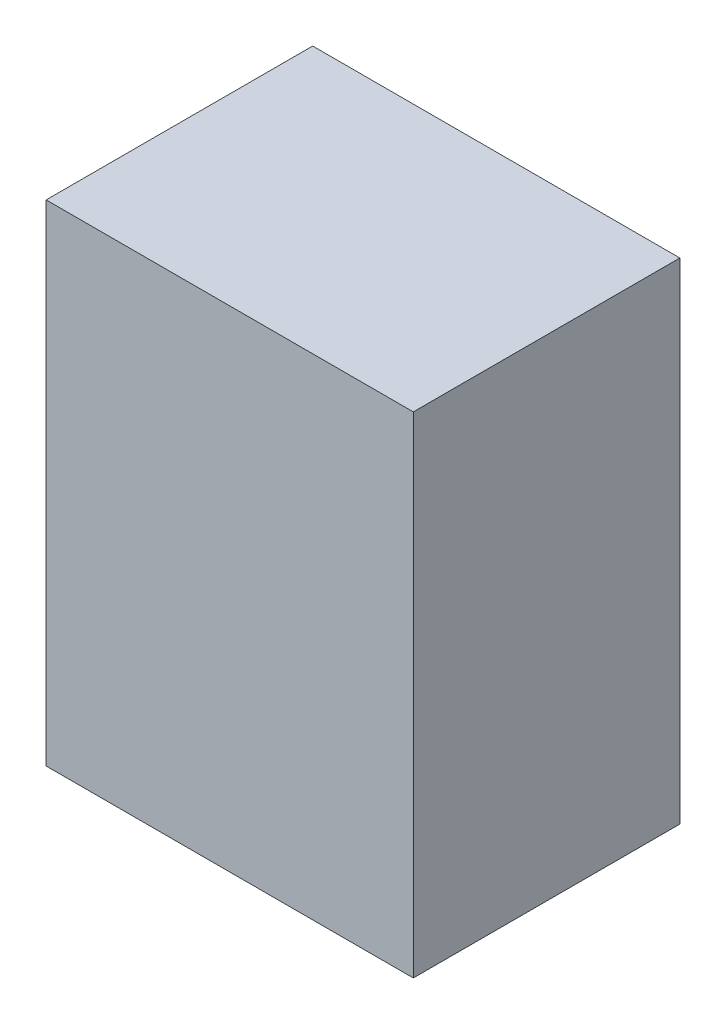
ISO-10303-21;
HEADER;
FILE_DESCRIPTION(('STEP AP214'),'2;1');
FILE_NAME('part.step','',(''),(''),'','','');
FILE_SCHEMA(('AUTOMOTIVE_DESIGN { 1 0 10303 214 1 1 1 1 }'));
ENDSEC;
DATA;
#1=APPLICATION_CONTEXT('core data for automotive mechanical design processes');
#2=APPLICATION_PROTOCOL_DEFINITION('international standard','automotive_design',2000,#1);
#3=PRODUCT_CONTEXT('',#1,'mechanical');
#4=PRODUCT('Part','Part','',(#3));
#5=PRODUCT_RELATED_PRODUCT_CATEGORY('part','',(#4));
#6=PRODUCT_DEFINITION_FORMATION('','',#4);
#7=PRODUCT_DEFINITION_CONTEXT('part definition',#1,'design');
#8=PRODUCT_DEFINITION('design','',#6,#7);
#9=PRODUCT_DEFINITION_SHAPE('','',#8);
#10=(LENGTH_UNIT() NAMED_UNIT(*) SI_UNIT(.MILLI.,.METRE.));
#11=(NAMED_UNIT(*) PLANE_ANGLE_UNIT() SI_UNIT($,.RADIAN.));
#12=(NAMED_UNIT(*) SI_UNIT($,.STERADIAN.) SOLID_ANGLE_UNIT());
#13=UNCERTAINTY_MEASURE_WITH_UNIT(LENGTH_MEASURE(1.E-05),#10,'distance_accuracy_value','');
#14=(GEOMETRIC_REPRESENTATION_CONTEXT(3) GLOBAL_UNCERTAINTY_ASSIGNED_CONTEXT((#13)) GLOBAL_UNIT_ASSIGNED_CONTEXT((#10,
#11,#12)) REPRESENTATION_CONTEXT('',''));
#15=CARTESIAN_POINT('',(0.,0.,0.));
#16=DIRECTION('',(0.,0.,1.));
#17=DIRECTION('',(1.,0.,0.));
#18=AXIS2_PLACEMENT_3D('',#15,#16,#17);
#19=CARTESIAN_POINT('',(50.9778000000001,68.072,37.0078));
#20=DIRECTION('',(1.,0.,0.));
#21=DIRECTION('',(0.,1.,0.));
#22=AXIS2_PLACEMENT_3D('',#19,#20,#21);
#23=PLANE('',#22);
#24=DIRECTION('',(0.,-1.,0.));
#25=VECTOR('',#24,1.);
#26=CARTESIAN_POINT('',(50.9778000000001,68.072,0.));
#27=LINE('',#26,#25);
#28=CARTESIAN_POINT('',(50.9778000000001,68.072,0.));
#29=VERTEX_POINT('',#28);
#30=CARTESIAN_POINT('',(50.9778,0.,0.));
#31=VERTEX_POINT('',#30);
#32=EDGE_CURVE('E67',#29,#31,#27,.T.);
#33=ORIENTED_EDGE('',*,*,#32,.F.);
#34=DIRECTION('',(0.,0.,-1.));
#35=VECTOR('',#34,1.);
#36=CARTESIAN_POINT('',(50.9778000000001,68.072,37.0078));
#37=LINE('',#36,#35);
#38=CARTESIAN_POINT('',(50.9778000000001,68.072,37.0078));
#39=VERTEX_POINT('',#38);
#40=EDGE_CURVE('E19',#39,#29,#37,.T.);
#41=ORIENTED_EDGE('',*,*,#40,.F.);
#42=DIRECTION('',(0.,-1.,0.));
#43=VECTOR('',#42,1.);
#44=CARTESIAN_POINT('',(50.9778000000001,68.072,37.0078));
#45=LINE('',#44,#43);
#46=CARTESIAN_POINT('',(50.9778,0.,37.0078));
#47=VERTEX_POINT('',#46);
#48=EDGE_CURVE('E69',#39,#47,#45,.T.);
#49=ORIENTED_EDGE('',*,*,#48,.T.);
#50=DIRECTION('',(0.,0.,-1.));
#51=VECTOR('',#50,1.);
#52=CARTESIAN_POINT('',(50.9778,0.,37.0078));
#53=LINE('',#52,#51);
#54=EDGE_CURVE('E11',#47,#31,#53,.T.);
#55=ORIENTED_EDGE('',*,*,#54,.T.);
#56=EDGE_LOOP('',(#33,#41,#49,#55));
#57=FACE_BOUND('',#56,.T.);
#58=ADVANCED_FACE('F16',(#57),#23,.T.);
#59=CARTESIAN_POINT('',(50.9778,0.,37.0078));
#60=DIRECTION('',(0.,-1.,0.));
#61=DIRECTION('',(0.,0.,-1.));
#62=AXIS2_PLACEMENT_3D('',#59,#60,#61);
#63=PLANE('',#62);
#64=DIRECTION('',(-1.,0.,0.));
#65=VECTOR('',#64,1.);
#66=CARTESIAN_POINT('',(50.9778,0.,0.));
#67=LINE('',#66,#65);
#68=CARTESIAN_POINT('',(0.,0.,0.));
#69=VERTEX_POINT('',#68);
#70=EDGE_CURVE('E72',#31,#69,#67,.T.);
#71=ORIENTED_EDGE('',*,*,#70,.F.);
#72=ORIENTED_EDGE('',*,*,#54,.F.);
#73=DIRECTION('',(-1.,0.,0.));
#74=VECTOR('',#73,1.);
#75=CARTESIAN_POINT('',(50.9778,0.,37.0078));
#76=LINE('',#75,#74);
#77=CARTESIAN_POINT('',(0.,0.,37.0078));
#78=VERTEX_POINT('',#77);
#79=EDGE_CURVE('E78',#47,#78,#76,.T.);
#80=ORIENTED_EDGE('',*,*,#79,.T.);
#81=DIRECTION('',(0.,0.,-1.));
#82=VECTOR('',#81,1.);
#83=CARTESIAN_POINT('',(0.,0.,37.0078));
#84=LINE('',#83,#82);
#85=EDGE_CURVE('E24',#78,#69,#84,.T.);
#86=ORIENTED_EDGE('',*,*,#85,.T.);
#87=EDGE_LOOP('',(#71,#72,#80,#86));
#88=FACE_BOUND('',#87,.T.);
#89=ADVANCED_FACE('F85',(#88),#63,.T.);
#90=CARTESIAN_POINT('',(0.,0.,37.0078));
#91=DIRECTION('',(-1.,0.,0.));
#92=DIRECTION('',(0.,-1.,0.));
#93=AXIS2_PLACEMENT_3D('',#90,#91,#92);
#94=PLANE('',#93);
#95=DIRECTION('',(0.,1.,0.));
#96=VECTOR('',#95,1.);
#97=CARTESIAN_POINT('',(0.,0.,0.));
#98=LINE('',#97,#96);
#99=CARTESIAN_POINT('',(0.,68.072,0.));
#100=VERTEX_POINT('',#99);
#101=EDGE_CURVE('E68',#69,#100,#98,.T.);
#102=ORIENTED_EDGE('',*,*,#101,.F.);
#103=ORIENTED_EDGE('',*,*,#85,.F.);
#104=DIRECTION('',(0.,1.,0.));
#105=VECTOR('',#104,1.);
#106=CARTESIAN_POINT('',(0.,0.,37.0078));
#107=LINE('',#106,#105);
#108=CARTESIAN_POINT('',(0.,68.072,37.0078));
#109=VERTEX_POINT('',#108);
#110=EDGE_CURVE('E80',#78,#109,#107,.T.);
#111=ORIENTED_EDGE('',*,*,#110,.T.);
#112=DIRECTION('',(0.,0.,-1.));
#113=VECTOR('',#112,1.);
#114=CARTESIAN_POINT('',(0.,68.072,37.0078));
#115=LINE('',#114,#113);
#116=EDGE_CURVE('E31',#109,#100,#115,.T.);
#117=ORIENTED_EDGE('',*,*,#116,.T.);
#118=EDGE_LOOP('',(#102,#103,#111,#117));
#119=FACE_BOUND('',#118,.T.);
#120=ADVANCED_FACE('F88',(#119),#94,.T.);
#121=CARTESIAN_POINT('',(0.,68.072,37.0078));
#122=DIRECTION('',(0.,1.,0.));
#123=DIRECTION('',(0.,0.,1.));
#124=AXIS2_PLACEMENT_3D('',#121,#122,#123);
#125=PLANE('',#124);
#126=DIRECTION('',(1.,0.,0.));
#127=VECTOR('',#126,1.);
#128=CARTESIAN_POINT('',(0.,68.072,0.));
#129=LINE('',#128,#127);
#130=EDGE_CURVE('E55',#100,#29,#129,.T.);
#131=ORIENTED_EDGE('',*,*,#130,.F.);
#132=ORIENTED_EDGE('',*,*,#116,.F.);
#133=DIRECTION('',(1.,0.,0.));
#134=VECTOR('',#133,1.);
#135=CARTESIAN_POINT('',(0.,68.072,37.0078));
#136=LINE('',#135,#134);
#137=EDGE_CURVE('E58',#109,#39,#136,.T.);
#138=ORIENTED_EDGE('',*,*,#137,.T.);
#139=ORIENTED_EDGE('',*,*,#40,.T.);
#140=EDGE_LOOP('',(#131,#132,#138,#139));
#141=FACE_BOUND('',#140,.T.);
#142=ADVANCED_FACE('F54',(#141),#125,.T.);
#143=CARTESIAN_POINT('',(50.9778,0.,37.0078));
#144=DIRECTION('',(0.,0.,-1.));
#145=DIRECTION('',(-1.,0.,0.));
#146=AXIS2_PLACEMENT_3D('',#143,#144,#145);
#147=PLANE('',#146);
#148=ORIENTED_EDGE('',*,*,#48,.F.);
#149=ORIENTED_EDGE('',*,*,#137,.F.);
#150=ORIENTED_EDGE('',*,*,#110,.F.);
#151=ORIENTED_EDGE('',*,*,#79,.F.);
#152=EDGE_LOOP('',(#148,#149,#150,#151));
#153=FACE_BOUND('',#152,.T.);
#154=ADVANCED_FACE('F90',(#153),#147,.F.);
#155=CARTESIAN_POINT('',(50.9778,0.,0.));
#156=DIRECTION('',(0.,0.,-1.));
#157=DIRECTION('',(-1.,0.,0.));
#158=AXIS2_PLACEMENT_3D('',#155,#156,#157);
#159=PLANE('',#158);
#160=ORIENTED_EDGE('',*,*,#32,.T.);
#161=ORIENTED_EDGE('',*,*,#70,.T.);
#162=ORIENTED_EDGE('',*,*,#101,.T.);
#163=ORIENTED_EDGE('',*,*,#130,.T.);
#164=EDGE_LOOP('',(#160,#161,#162,#163));
#165=FACE_BOUND('',#164,.T.);
#166=ADVANCED_FACE('F65',(#165),#159,.T.);
#167=CLOSED_SHELL('',(#58,#89,#120,#142,#154,#166));
#168=MANIFOLD_SOLID_BREP('B1',#167);
#169=ADVANCED_BREP_SHAPE_REPRESENTATION('',(#18,#168),#14);
#170=SHAPE_DEFINITION_REPRESENTATION(#9,#169);
ENDSEC;
END-ISO-10303-21;
